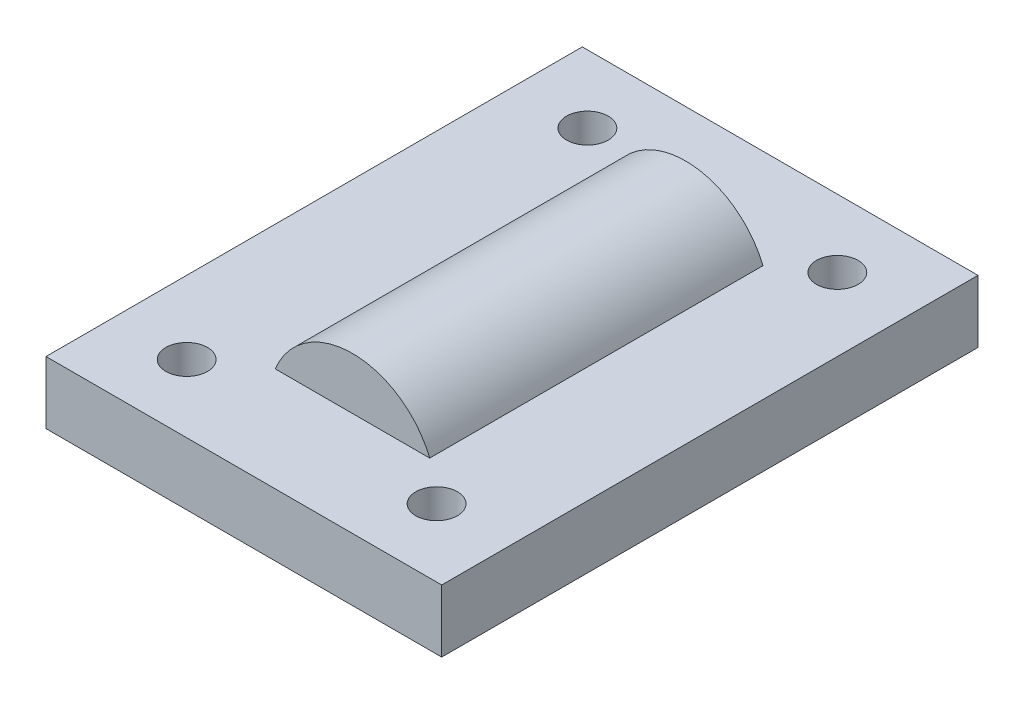
ISO-10303-21;
HEADER;
FILE_DESCRIPTION(('STEP AP214'),'2;1');
FILE_NAME('part.step','',(''),(''),'','','');
FILE_SCHEMA(('AUTOMOTIVE_DESIGN { 1 0 10303 214 1 1 1 1 }'));
ENDSEC;
DATA;
#1=APPLICATION_CONTEXT('core data for automotive mechanical design processes');
#2=APPLICATION_PROTOCOL_DEFINITION('international standard','automotive_design',2000,#1);
#3=PRODUCT_CONTEXT('',#1,'mechanical');
#4=PRODUCT('Part','Part','',(#3));
#5=PRODUCT_RELATED_PRODUCT_CATEGORY('part','',(#4));
#6=PRODUCT_DEFINITION_FORMATION('','',#4);
#7=PRODUCT_DEFINITION_CONTEXT('part definition',#1,'design');
#8=PRODUCT_DEFINITION('design','',#6,#7);
#9=PRODUCT_DEFINITION_SHAPE('','',#8);
#10=(LENGTH_UNIT() NAMED_UNIT(*) SI_UNIT(.MILLI.,.METRE.));
#11=(NAMED_UNIT(*) PLANE_ANGLE_UNIT() SI_UNIT($,.RADIAN.));
#12=(NAMED_UNIT(*) SI_UNIT($,.STERADIAN.) SOLID_ANGLE_UNIT());
#13=UNCERTAINTY_MEASURE_WITH_UNIT(LENGTH_MEASURE(1.E-05),#10,'distance_accuracy_value','');
#14=(GEOMETRIC_REPRESENTATION_CONTEXT(3) GLOBAL_UNCERTAINTY_ASSIGNED_CONTEXT((#13)) GLOBAL_UNIT_ASSIGNED_CONTEXT((#10,
#11,#12)) REPRESENTATION_CONTEXT('',''));
#15=CARTESIAN_POINT('',(0.,0.,0.));
#16=DIRECTION('',(0.,0.,1.));
#17=DIRECTION('',(1.,0.,0.));
#18=AXIS2_PLACEMENT_3D('',#15,#16,#17);
#19=CARTESIAN_POINT('',(0.,3.,0.));
#20=DIRECTION('',(0.,1.,0.));
#21=DIRECTION('',(0.,0.,1.));
#22=AXIS2_PLACEMENT_3D('',#19,#20,#21);
#23=PLANE('',#22);
#24=CARTESIAN_POINT('',(5.77308849420747,3.,9.73345582928197));
#25=DIRECTION('',(0.,1.,0.));
#26=DIRECTION('',(0.,0.,1.));
#27=AXIS2_PLACEMENT_3D('',#24,#25,#26);
#28=CIRCLE('',#27,1.00000005240316);
#29=CARTESIAN_POINT('',(5.77308849420747,3.,10.7334558816851));
#30=VERTEX_POINT('',#29);
#31=EDGE_CURVE('E123',#30,#30,#28,.T.);
#32=ORIENTED_EDGE('',*,*,#31,.F.);
#33=EDGE_LOOP('',(#32));
#34=FACE_BOUND('',#33,.T.);
#35=CARTESIAN_POINT('',(-6.2269113611773,3.,-9.50654420802245));
#36=DIRECTION('',(0.,1.,0.));
#37=DIRECTION('',(0.,0.,1.));
#38=AXIS2_PLACEMENT_3D('',#35,#36,#37);
#39=CIRCLE('',#38,1.00000002874144);
#40=CARTESIAN_POINT('',(-6.2269113611773,3.,-8.506544179281));
#41=VERTEX_POINT('',#40);
#42=EDGE_CURVE('E139',#41,#41,#39,.T.);
#43=ORIENTED_EDGE('',*,*,#42,.F.);
#44=EDGE_LOOP('',(#43));
#45=FACE_BOUND('',#44,.T.);
#46=DIRECTION('',(0.,0.,-1.));
#47=VECTOR('',#46,1.);
#48=CARTESIAN_POINT('',(9.27308856138775,3.,12.9884557193061));
#49=LINE('',#48,#47);
#50=CARTESIAN_POINT('',(9.27308856138775,3.,12.9884557193061));
#51=VERTEX_POINT('',#50);
#52=CARTESIAN_POINT('',(9.27308856138775,3.,-12.7615442806939));
#53=VERTEX_POINT('',#52);
#54=EDGE_CURVE('E147',#51,#53,#49,.T.);
#55=ORIENTED_EDGE('',*,*,#54,.T.);
#56=DIRECTION('',(-1.,0.,0.));
#57=VECTOR('',#56,1.);
#58=CARTESIAN_POINT('',(9.27308856138775,3.,-12.7615442806939));
#59=LINE('',#58,#57);
#60=CARTESIAN_POINT('',(-9.72691143861225,3.,-12.7615442806939));
#61=VERTEX_POINT('',#60);
#62=EDGE_CURVE('E151',#53,#61,#59,.T.);
#63=ORIENTED_EDGE('',*,*,#62,.T.);
#64=DIRECTION('',(0.,0.,1.));
#65=VECTOR('',#64,1.);
#66=CARTESIAN_POINT('',(-9.72691143861225,3.,-12.7615442806939));
#67=LINE('',#66,#65);
#68=CARTESIAN_POINT('',(-9.72691143861225,3.,12.9884557193061));
#69=VERTEX_POINT('',#68);
#70=EDGE_CURVE('E155',#61,#69,#67,.T.);
#71=ORIENTED_EDGE('',*,*,#70,.T.);
#72=DIRECTION('',(1.,0.,0.));
#73=VECTOR('',#72,1.);
#74=CARTESIAN_POINT('',(-9.72691143861225,3.,12.9884557193061));
#75=LINE('',#74,#73);
#76=EDGE_CURVE('E158',#69,#51,#75,.T.);
#77=ORIENTED_EDGE('',*,*,#76,.T.);
#78=EDGE_LOOP('',(#55,#63,#71,#77));
#79=FACE_BOUND('',#78,.T.);
#80=CARTESIAN_POINT('',(5.77308826734874,3.,-9.50654431314554));
#81=DIRECTION('',(0.,1.,0.));
#82=DIRECTION('',(0.,0.,1.));
#83=AXIS2_PLACEMENT_3D('',#80,#81,#82);
#84=CIRCLE('',#83,0.999999792139125);
#85=CARTESIAN_POINT('',(5.77308826734874,3.,-8.50654452100641));
#86=VERTEX_POINT('',#85);
#87=EDGE_CURVE('E131',#86,#86,#84,.T.);
#88=ORIENTED_EDGE('',*,*,#87,.F.);
#89=EDGE_LOOP('',(#88));
#90=FACE_BOUND('',#89,.T.);
#91=CARTESIAN_POINT('',(-6.2269112675232,3.,9.73345569781426));
#92=DIRECTION('',(0.,1.,0.));
#93=DIRECTION('',(0.,0.,1.));
#94=AXIS2_PLACEMENT_3D('',#91,#92,#93);
#95=CIRCLE('',#94,1.00000005919242);
#96=CARTESIAN_POINT('',(-6.2269112675232,3.,10.7334557570067));
#97=VERTEX_POINT('',#96);
#98=EDGE_CURVE('E115',#97,#97,#95,.T.);
#99=ORIENTED_EDGE('',*,*,#98,.F.);
#100=EDGE_LOOP('',(#99));
#101=FACE_BOUND('',#100,.T.);
#102=DIRECTION('',(0.,0.,1.));
#103=VECTOR('',#102,1.);
#104=CARTESIAN_POINT('',(-3.70809924354783,3.,-8.));
#105=LINE('',#104,#103);
#106=CARTESIAN_POINT('',(-3.70809924354783,3.,-8.));
#107=VERTEX_POINT('',#106);
#108=CARTESIAN_POINT('',(-3.70809924354783,3.,8.));
#109=VERTEX_POINT('',#108);
#110=EDGE_CURVE('E55',#107,#109,#105,.T.);
#111=ORIENTED_EDGE('',*,*,#110,.F.);
#112=DIRECTION('',(1.,0.,0.));
#113=VECTOR('',#112,1.);
#114=CARTESIAN_POINT('',(-3.70809924354783,3.,-8.));
#115=LINE('',#114,#113);
#116=CARTESIAN_POINT('',(3.70809924354783,3.,-8.));
#117=VERTEX_POINT('',#116);
#118=EDGE_CURVE('E60',#107,#117,#115,.T.);
#119=ORIENTED_EDGE('',*,*,#118,.T.);
#120=DIRECTION('',(0.,0.,1.));
#121=VECTOR('',#120,1.);
#122=CARTESIAN_POINT('',(3.70809924354783,3.,-8.));
#123=LINE('',#122,#121);
#124=CARTESIAN_POINT('',(3.70809924354783,3.,8.));
#125=VERTEX_POINT('',#124);
#126=EDGE_CURVE('E89',#117,#125,#123,.T.);
#127=ORIENTED_EDGE('',*,*,#126,.T.);
#128=DIRECTION('',(1.,0.,0.));
#129=VECTOR('',#128,1.);
#130=CARTESIAN_POINT('',(-3.70809924354783,3.,8.));
#131=LINE('',#130,#129);
#132=EDGE_CURVE('E91',#109,#125,#131,.T.);
#133=ORIENTED_EDGE('',*,*,#132,.F.);
#134=EDGE_LOOP('',(#111,#119,#127,#133));
#135=FACE_BOUND('',#134,.T.);
#136=ADVANCED_FACE('F39',(#34,#45,#79,#90,#101,#135),#23,.T.);
#137=CARTESIAN_POINT('',(0.,0.,0.));
#138=DIRECTION('',(0.,1.,0.));
#139=DIRECTION('',(0.,0.,1.));
#140=AXIS2_PLACEMENT_3D('',#137,#138,#139);
#141=PLANE('',#140);
#142=DIRECTION('',(0.,0.,-1.));
#143=VECTOR('',#142,1.);
#144=CARTESIAN_POINT('',(9.27308856138775,0.,12.9884557193061));
#145=LINE('',#144,#143);
#146=CARTESIAN_POINT('',(9.27308856138775,0.,12.9884557193061));
#147=VERTEX_POINT('',#146);
#148=CARTESIAN_POINT('',(9.27308856138775,0.,-12.7615442806939));
#149=VERTEX_POINT('',#148);
#150=EDGE_CURVE('E143',#147,#149,#145,.T.);
#151=ORIENTED_EDGE('',*,*,#150,.F.);
#152=DIRECTION('',(1.,0.,0.));
#153=VECTOR('',#152,1.);
#154=CARTESIAN_POINT('',(-9.72691143861225,0.,12.9884557193061));
#155=LINE('',#154,#153);
#156=CARTESIAN_POINT('',(-9.72691143861225,0.,12.9884557193061));
#157=VERTEX_POINT('',#156);
#158=EDGE_CURVE('E152',#157,#147,#155,.T.);
#159=ORIENTED_EDGE('',*,*,#158,.F.);
#160=DIRECTION('',(0.,0.,1.));
#161=VECTOR('',#160,1.);
#162=CARTESIAN_POINT('',(-9.72691143861225,0.,-12.7615442806939));
#163=LINE('',#162,#161);
#164=CARTESIAN_POINT('',(-9.72691143861225,0.,-12.7615442806939));
#165=VERTEX_POINT('',#164);
#166=EDGE_CURVE('E168',#165,#157,#163,.T.);
#167=ORIENTED_EDGE('',*,*,#166,.F.);
#168=DIRECTION('',(-1.,0.,0.));
#169=VECTOR('',#168,1.);
#170=CARTESIAN_POINT('',(9.27308856138775,0.,-12.7615442806939));
#171=LINE('',#170,#169);
#172=EDGE_CURVE('E165',#149,#165,#171,.T.);
#173=ORIENTED_EDGE('',*,*,#172,.F.);
#174=EDGE_LOOP('',(#151,#159,#167,#173));
#175=FACE_BOUND('',#174,.T.);
#176=CARTESIAN_POINT('',(-6.2269113611773,0.,-9.50654420802245));
#177=DIRECTION('',(0.,1.,0.));
#178=DIRECTION('',(0.,0.,1.));
#179=AXIS2_PLACEMENT_3D('',#176,#177,#178);
#180=CIRCLE('',#179,1.00000002874144);
#181=CARTESIAN_POINT('',(-6.2269113611773,0.,-8.506544179281));
#182=VERTEX_POINT('',#181);
#183=EDGE_CURVE('E135',#182,#182,#180,.T.);
#184=ORIENTED_EDGE('',*,*,#183,.T.);
#185=EDGE_LOOP('',(#184));
#186=FACE_BOUND('',#185,.T.);
#187=CARTESIAN_POINT('',(5.77308826734874,0.,-9.50654431314554));
#188=DIRECTION('',(0.,1.,0.));
#189=DIRECTION('',(0.,0.,1.));
#190=AXIS2_PLACEMENT_3D('',#187,#188,#189);
#191=CIRCLE('',#190,0.999999792139125);
#192=CARTESIAN_POINT('',(5.77308826734874,0.,-8.50654452100641));
#193=VERTEX_POINT('',#192);
#194=EDGE_CURVE('E127',#193,#193,#191,.T.);
#195=ORIENTED_EDGE('',*,*,#194,.T.);
#196=EDGE_LOOP('',(#195));
#197=FACE_BOUND('',#196,.T.);
#198=CARTESIAN_POINT('',(5.77308849420747,0.,9.73345582928197));
#199=DIRECTION('',(0.,1.,0.));
#200=DIRECTION('',(0.,0.,1.));
#201=AXIS2_PLACEMENT_3D('',#198,#199,#200);
#202=CIRCLE('',#201,1.00000005240316);
#203=CARTESIAN_POINT('',(5.77308849420747,0.,10.7334558816851));
#204=VERTEX_POINT('',#203);
#205=EDGE_CURVE('E119',#204,#204,#202,.T.);
#206=ORIENTED_EDGE('',*,*,#205,.T.);
#207=EDGE_LOOP('',(#206));
#208=FACE_BOUND('',#207,.T.);
#209=CARTESIAN_POINT('',(-6.2269112675232,0.,9.73345569781426));
#210=DIRECTION('',(0.,1.,0.));
#211=DIRECTION('',(0.,0.,1.));
#212=AXIS2_PLACEMENT_3D('',#209,#210,#211);
#213=CIRCLE('',#212,1.00000005919242);
#214=CARTESIAN_POINT('',(-6.2269112675232,0.,10.7334557570067));
#215=VERTEX_POINT('',#214);
#216=EDGE_CURVE('E96',#215,#215,#213,.T.);
#217=ORIENTED_EDGE('',*,*,#216,.T.);
#218=EDGE_LOOP('',(#217));
#219=FACE_BOUND('',#218,.T.);
#220=ADVANCED_FACE('F191',(#175,#186,#197,#208,#219),#141,.F.);
#221=CARTESIAN_POINT('',(9.27308856138775,3.,12.9884557193061));
#222=DIRECTION('',(-1.,0.,0.));
#223=DIRECTION('',(0.,0.,1.));
#224=AXIS2_PLACEMENT_3D('',#221,#222,#223);
#225=PLANE('',#224);
#226=ORIENTED_EDGE('',*,*,#150,.T.);
#227=DIRECTION('',(0.,-1.,0.));
#228=VECTOR('',#227,1.);
#229=CARTESIAN_POINT('',(9.27308856138775,3.,-12.7615442806939));
#230=LINE('',#229,#228);
#231=EDGE_CURVE('E11',#53,#149,#230,.T.);
#232=ORIENTED_EDGE('',*,*,#231,.F.);
#233=ORIENTED_EDGE('',*,*,#54,.F.);
#234=DIRECTION('',(0.,-1.,0.));
#235=VECTOR('',#234,1.);
#236=CARTESIAN_POINT('',(9.27308856138775,3.,12.9884557193061));
#237=LINE('',#236,#235);
#238=EDGE_CURVE('E161',#51,#147,#237,.T.);
#239=ORIENTED_EDGE('',*,*,#238,.T.);
#240=EDGE_LOOP('',(#226,#232,#233,#239));
#241=FACE_BOUND('',#240,.T.);
#242=ADVANCED_FACE('F41',(#241),#225,.F.);
#243=CARTESIAN_POINT('',(9.27308856138775,3.,-12.7615442806939));
#244=DIRECTION('',(0.,0.,1.));
#245=DIRECTION('',(1.,0.,0.));
#246=AXIS2_PLACEMENT_3D('',#243,#244,#245);
#247=PLANE('',#246);
#248=ORIENTED_EDGE('',*,*,#172,.T.);
#249=DIRECTION('',(0.,-1.,0.));
#250=VECTOR('',#249,1.);
#251=CARTESIAN_POINT('',(-9.72691143861225,3.,-12.7615442806939));
#252=LINE('',#251,#250);
#253=EDGE_CURVE('E48',#61,#165,#252,.T.);
#254=ORIENTED_EDGE('',*,*,#253,.F.);
#255=ORIENTED_EDGE('',*,*,#62,.F.);
#256=ORIENTED_EDGE('',*,*,#231,.T.);
#257=EDGE_LOOP('',(#248,#254,#255,#256));
#258=FACE_BOUND('',#257,.T.);
#259=ADVANCED_FACE('F202',(#258),#247,.F.);
#260=CARTESIAN_POINT('',(-9.72691143861225,3.,-12.7615442806939));
#261=DIRECTION('',(1.,0.,0.));
#262=DIRECTION('',(0.,0.,-1.));
#263=AXIS2_PLACEMENT_3D('',#260,#261,#262);
#264=PLANE('',#263);
#265=ORIENTED_EDGE('',*,*,#166,.T.);
#266=DIRECTION('',(0.,-1.,0.));
#267=VECTOR('',#266,1.);
#268=CARTESIAN_POINT('',(-9.72691143861225,3.,12.9884557193061));
#269=LINE('',#268,#267);
#270=EDGE_CURVE('E176',#69,#157,#269,.T.);
#271=ORIENTED_EDGE('',*,*,#270,.F.);
#272=ORIENTED_EDGE('',*,*,#70,.F.);
#273=ORIENTED_EDGE('',*,*,#253,.T.);
#274=EDGE_LOOP('',(#265,#271,#272,#273));
#275=FACE_BOUND('',#274,.T.);
#276=ADVANCED_FACE('F185',(#275),#264,.F.);
#277=CARTESIAN_POINT('',(-9.72691143861225,3.,12.9884557193061));
#278=DIRECTION('',(0.,0.,-1.));
#279=DIRECTION('',(-1.,0.,0.));
#280=AXIS2_PLACEMENT_3D('',#277,#278,#279);
#281=PLANE('',#280);
#282=ORIENTED_EDGE('',*,*,#158,.T.);
#283=ORIENTED_EDGE('',*,*,#238,.F.);
#284=ORIENTED_EDGE('',*,*,#76,.F.);
#285=ORIENTED_EDGE('',*,*,#270,.T.);
#286=EDGE_LOOP('',(#282,#283,#284,#285));
#287=FACE_BOUND('',#286,.T.);
#288=ADVANCED_FACE('F195',(#287),#281,.F.);
#289=CARTESIAN_POINT('',(-6.2269113611773,3.,-9.50654420802245));
#290=DIRECTION('',(0.,-1.,0.));
#291=DIRECTION('',(0.,0.,-1.));
#292=AXIS2_PLACEMENT_3D('',#289,#290,#291);
#293=CYLINDRICAL_SURFACE('',#292,1.00000002874144);
#294=ORIENTED_EDGE('',*,*,#42,.T.);
#295=EDGE_LOOP('',(#294));
#296=FACE_BOUND('',#295,.T.);
#297=ORIENTED_EDGE('',*,*,#183,.F.);
#298=EDGE_LOOP('',(#297));
#299=FACE_BOUND('',#298,.T.);
#300=ADVANCED_FACE('F219',(#296,#299),#293,.F.);
#301=CARTESIAN_POINT('',(5.77308826734874,3.,-9.50654431314554));
#302=DIRECTION('',(0.,-1.,0.));
#303=DIRECTION('',(0.,0.,-1.));
#304=AXIS2_PLACEMENT_3D('',#301,#302,#303);
#305=CYLINDRICAL_SURFACE('',#304,0.999999792139125);
#306=ORIENTED_EDGE('',*,*,#87,.T.);
#307=EDGE_LOOP('',(#306));
#308=FACE_BOUND('',#307,.T.);
#309=ORIENTED_EDGE('',*,*,#194,.F.);
#310=EDGE_LOOP('',(#309));
#311=FACE_BOUND('',#310,.T.);
#312=ADVANCED_FACE('F226',(#308,#311),#305,.F.);
#313=CARTESIAN_POINT('',(5.77308849420747,3.,9.73345582928197));
#314=DIRECTION('',(0.,-1.,0.));
#315=DIRECTION('',(0.,0.,-1.));
#316=AXIS2_PLACEMENT_3D('',#313,#314,#315);
#317=CYLINDRICAL_SURFACE('',#316,1.00000005240316);
#318=ORIENTED_EDGE('',*,*,#31,.T.);
#319=EDGE_LOOP('',(#318));
#320=FACE_BOUND('',#319,.T.);
#321=ORIENTED_EDGE('',*,*,#205,.F.);
#322=EDGE_LOOP('',(#321));
#323=FACE_BOUND('',#322,.T.);
#324=ADVANCED_FACE('F231',(#320,#323),#317,.F.);
#325=CARTESIAN_POINT('',(-6.2269112675232,3.,9.73345569781426));
#326=DIRECTION('',(0.,-1.,0.));
#327=DIRECTION('',(0.,0.,-1.));
#328=AXIS2_PLACEMENT_3D('',#325,#326,#327);
#329=CYLINDRICAL_SURFACE('',#328,1.00000005919242);
#330=ORIENTED_EDGE('',*,*,#98,.T.);
#331=EDGE_LOOP('',(#330));
#332=FACE_BOUND('',#331,.T.);
#333=ORIENTED_EDGE('',*,*,#216,.F.);
#334=EDGE_LOOP('',(#333));
#335=FACE_BOUND('',#334,.T.);
#336=ADVANCED_FACE('F243',(#332,#335),#329,.F.);
#337=CARTESIAN_POINT('',(0.,1.5,-8.));
#338=DIRECTION('',(0.,0.,1.));
#339=DIRECTION('',(1.,0.,0.));
#340=AXIS2_PLACEMENT_3D('',#337,#338,#339);
#341=CYLINDRICAL_SURFACE('',#340,4.);
#342=ORIENTED_EDGE('',*,*,#110,.T.);
#343=CARTESIAN_POINT('',(0.,1.5,8.));
#344=DIRECTION('',(0.,0.,1.));
#345=DIRECTION('',(1.,0.,0.));
#346=AXIS2_PLACEMENT_3D('',#343,#344,#345);
#347=CIRCLE('',#346,4.);
#348=EDGE_CURVE('E101',#125,#109,#347,.T.);
#349=ORIENTED_EDGE('',*,*,#348,.F.);
#350=ORIENTED_EDGE('',*,*,#126,.F.);
#351=CARTESIAN_POINT('',(0.,1.5,-8.));
#352=DIRECTION('',(0.,0.,1.));
#353=DIRECTION('',(1.,0.,0.));
#354=AXIS2_PLACEMENT_3D('',#351,#352,#353);
#355=CIRCLE('',#354,4.);
#356=EDGE_CURVE('E103',#117,#107,#355,.T.);
#357=ORIENTED_EDGE('',*,*,#356,.T.);
#358=EDGE_LOOP('',(#342,#349,#350,#357));
#359=FACE_BOUND('',#358,.T.);
#360=ADVANCED_FACE('F105',(#359),#341,.T.);
#361=CARTESIAN_POINT('',(0.,1.5,-8.));
#362=DIRECTION('',(0.,0.,1.));
#363=DIRECTION('',(1.,0.,0.));
#364=AXIS2_PLACEMENT_3D('',#361,#362,#363);
#365=PLANE('',#364);
#366=ORIENTED_EDGE('',*,*,#356,.F.);
#367=ORIENTED_EDGE('',*,*,#118,.F.);
#368=EDGE_LOOP('',(#366,#367));
#369=FACE_BOUND('',#368,.T.);
#370=ADVANCED_FACE('F251',(#369),#365,.F.);
#371=CARTESIAN_POINT('',(0.,1.5,8.));
#372=DIRECTION('',(0.,0.,1.));
#373=DIRECTION('',(1.,0.,0.));
#374=AXIS2_PLACEMENT_3D('',#371,#372,#373);
#375=PLANE('',#374);
#376=ORIENTED_EDGE('',*,*,#348,.T.);
#377=ORIENTED_EDGE('',*,*,#132,.T.);
#378=EDGE_LOOP('',(#376,#377));
#379=FACE_BOUND('',#378,.T.);
#380=ADVANCED_FACE('F100',(#379),#375,.T.);
#381=CLOSED_SHELL('',(#136,#220,#242,#259,#276,#288,#300,#312,#324,#336,#360,#370,#380));
#382=MANIFOLD_SOLID_BREP('B2',#381);
#383=ADVANCED_BREP_SHAPE_REPRESENTATION('',(#18,#382),#14);
#384=SHAPE_DEFINITION_REPRESENTATION(#9,#383);
ENDSEC;
END-ISO-10303-21;
